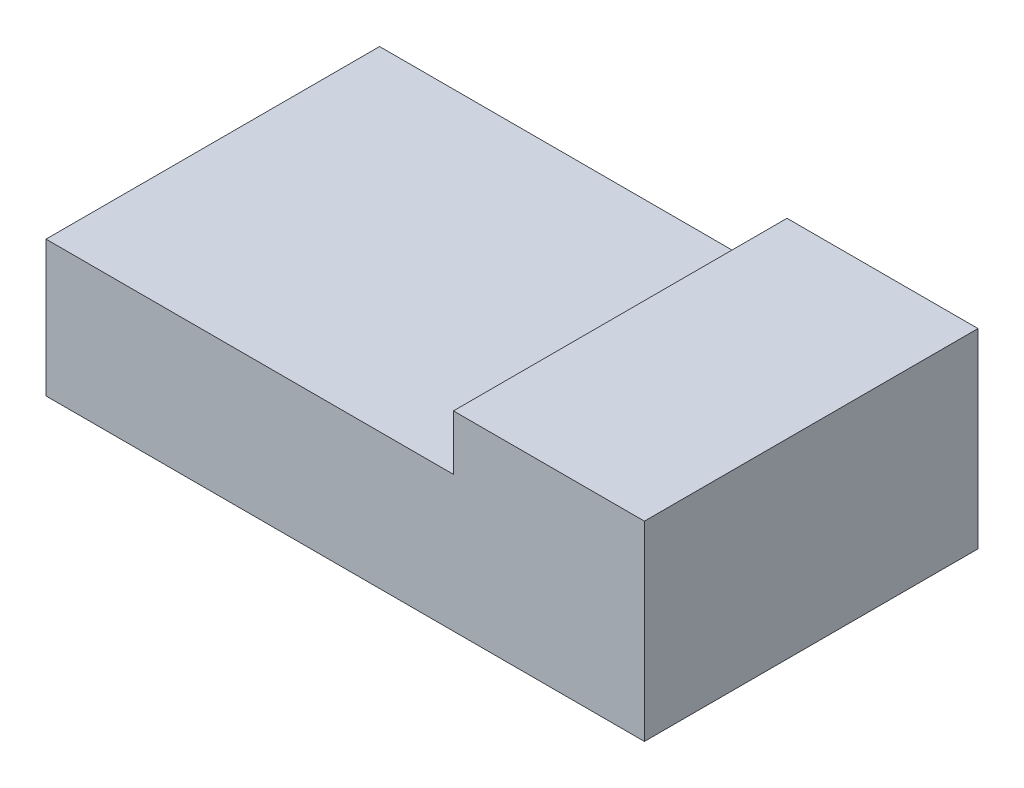
ISO-10303-21;
HEADER;
FILE_DESCRIPTION(('STEP AP214'),'2;1');
FILE_NAME('part.step','',(''),(''),'','','');
FILE_SCHEMA(('AUTOMOTIVE_DESIGN { 1 0 10303 214 1 1 1 1 }'));
ENDSEC;
DATA;
#1=APPLICATION_CONTEXT('core data for automotive mechanical design processes');
#2=APPLICATION_PROTOCOL_DEFINITION('international standard','automotive_design',2000,#1);
#3=PRODUCT_CONTEXT('',#1,'mechanical');
#4=PRODUCT('Part','Part','',(#3));
#5=PRODUCT_RELATED_PRODUCT_CATEGORY('part','',(#4));
#6=PRODUCT_DEFINITION_FORMATION('','',#4);
#7=PRODUCT_DEFINITION_CONTEXT('part definition',#1,'design');
#8=PRODUCT_DEFINITION('design','',#6,#7);
#9=PRODUCT_DEFINITION_SHAPE('','',#8);
#10=(LENGTH_UNIT() NAMED_UNIT(*) SI_UNIT(.MILLI.,.METRE.));
#11=(NAMED_UNIT(*) PLANE_ANGLE_UNIT() SI_UNIT($,.RADIAN.));
#12=(NAMED_UNIT(*) SI_UNIT($,.STERADIAN.) SOLID_ANGLE_UNIT());
#13=UNCERTAINTY_MEASURE_WITH_UNIT(LENGTH_MEASURE(1.E-05),#10,'distance_accuracy_value','');
#14=(GEOMETRIC_REPRESENTATION_CONTEXT(3) GLOBAL_UNCERTAINTY_ASSIGNED_CONTEXT((#13)) GLOBAL_UNIT_ASSIGNED_CONTEXT((#10,
#11,#12)) REPRESENTATION_CONTEXT('',''));
#15=CARTESIAN_POINT('',(0.,0.,0.));
#16=DIRECTION('',(0.,0.,1.));
#17=DIRECTION('',(1.,0.,0.));
#18=AXIS2_PLACEMENT_3D('',#15,#16,#17);
#19=CARTESIAN_POINT('',(0.,10.668,0.));
#20=DIRECTION('',(1.,0.,0.));
#21=DIRECTION('',(0.,0.,-1.));
#22=AXIS2_PLACEMENT_3D('',#19,#20,#21);
#23=PLANE('',#22);
#24=DIRECTION('',(0.,0.,1.));
#25=VECTOR('',#24,1.);
#26=CARTESIAN_POINT('',(0.,0.,0.));
#27=LINE('',#26,#25);
#28=CARTESIAN_POINT('',(0.,0.,0.));
#29=VERTEX_POINT('',#28);
#30=CARTESIAN_POINT('',(0.,0.,26.2));
#31=VERTEX_POINT('',#30);
#32=EDGE_CURVE('E93',#29,#31,#27,.T.);
#33=ORIENTED_EDGE('',*,*,#32,.T.);
#34=DIRECTION('',(0.,-1.,0.));
#35=VECTOR('',#34,1.);
#36=CARTESIAN_POINT('',(0.,10.668,26.2));
#37=LINE('',#36,#35);
#38=CARTESIAN_POINT('',(0.,10.668,26.2));
#39=VERTEX_POINT('',#38);
#40=EDGE_CURVE('E12',#39,#31,#37,.T.);
#41=ORIENTED_EDGE('',*,*,#40,.F.);
#42=DIRECTION('',(0.,0.,1.));
#43=VECTOR('',#42,1.);
#44=CARTESIAN_POINT('',(0.,10.668,0.));
#45=LINE('',#44,#43);
#46=CARTESIAN_POINT('',(0.,10.668,0.));
#47=VERTEX_POINT('',#46);
#48=EDGE_CURVE('E87',#47,#39,#45,.T.);
#49=ORIENTED_EDGE('',*,*,#48,.F.);
#50=DIRECTION('',(0.,-1.,0.));
#51=VECTOR('',#50,1.);
#52=CARTESIAN_POINT('',(0.,10.668,0.));
#53=LINE('',#52,#51);
#54=EDGE_CURVE('E79',#47,#29,#53,.T.);
#55=ORIENTED_EDGE('',*,*,#54,.T.);
#56=EDGE_LOOP('',(#33,#41,#49,#55));
#57=FACE_BOUND('',#56,.T.);
#58=ADVANCED_FACE('F37',(#57),#23,.F.);
#59=CARTESIAN_POINT('',(0.,10.668,26.2));
#60=DIRECTION('',(0.,0.,-1.));
#61=DIRECTION('',(-1.,0.,0.));
#62=AXIS2_PLACEMENT_3D('',#59,#60,#61);
#63=PLANE('',#62);
#64=DIRECTION('',(1.,0.,0.));
#65=VECTOR('',#64,1.);
#66=CARTESIAN_POINT('',(0.,0.,26.2));
#67=LINE('',#66,#65);
#68=CARTESIAN_POINT('',(47.,0.,26.2));
#69=VERTEX_POINT('',#68);
#70=EDGE_CURVE('E96',#31,#69,#67,.T.);
#71=ORIENTED_EDGE('',*,*,#70,.T.);
#72=DIRECTION('',(0.,-1.,0.));
#73=VECTOR('',#72,1.);
#74=CARTESIAN_POINT('',(47.,10.668,26.2));
#75=LINE('',#74,#73);
#76=CARTESIAN_POINT('',(47.,14.986,26.2));
#77=VERTEX_POINT('',#76);
#78=EDGE_CURVE('E44',#77,#69,#75,.T.);
#79=ORIENTED_EDGE('',*,*,#78,.F.);
#80=DIRECTION('',(1.,0.,0.));
#81=VECTOR('',#80,1.);
#82=CARTESIAN_POINT('',(47.,14.986,26.2));
#83=LINE('',#82,#81);
#84=CARTESIAN_POINT('',(32.,14.986,26.2));
#85=VERTEX_POINT('',#84);
#86=EDGE_CURVE('E120',#85,#77,#83,.T.);
#87=ORIENTED_EDGE('',*,*,#86,.F.);
#88=DIRECTION('',(0.,-1.,0.));
#89=VECTOR('',#88,1.);
#90=CARTESIAN_POINT('',(32.,60.162064590855,26.2));
#91=LINE('',#90,#89);
#92=CARTESIAN_POINT('',(32.,10.668,26.2));
#93=VERTEX_POINT('',#92);
#94=EDGE_CURVE('E131',#85,#93,#91,.T.);
#95=ORIENTED_EDGE('',*,*,#94,.T.);
#96=DIRECTION('',(1.,0.,0.));
#97=VECTOR('',#96,1.);
#98=CARTESIAN_POINT('',(0.,10.668,26.2));
#99=LINE('',#98,#97);
#100=EDGE_CURVE('E141',#39,#93,#99,.T.);
#101=ORIENTED_EDGE('',*,*,#100,.F.);
#102=ORIENTED_EDGE('',*,*,#40,.T.);
#103=EDGE_LOOP('',(#71,#79,#87,#95,#101,#102));
#104=FACE_BOUND('',#103,.T.);
#105=ADVANCED_FACE('F117',(#104),#63,.F.);
#106=CARTESIAN_POINT('',(47.,10.668,0.));
#107=DIRECTION('',(-1.,0.,0.));
#108=DIRECTION('',(0.,0.,1.));
#109=AXIS2_PLACEMENT_3D('',#106,#107,#108);
#110=PLANE('',#109);
#111=DIRECTION('',(0.,0.,-1.));
#112=VECTOR('',#111,1.);
#113=CARTESIAN_POINT('',(47.,0.,0.));
#114=LINE('',#113,#112);
#115=CARTESIAN_POINT('',(47.,0.,0.));
#116=VERTEX_POINT('',#115);
#117=EDGE_CURVE('E88',#69,#116,#114,.T.);
#118=ORIENTED_EDGE('',*,*,#117,.T.);
#119=DIRECTION('',(0.,-1.,0.));
#120=VECTOR('',#119,1.);
#121=CARTESIAN_POINT('',(47.,10.668,0.));
#122=LINE('',#121,#120);
#123=CARTESIAN_POINT('',(47.,14.986,0.));
#124=VERTEX_POINT('',#123);
#125=EDGE_CURVE('E83',#124,#116,#122,.T.);
#126=ORIENTED_EDGE('',*,*,#125,.F.);
#127=DIRECTION('',(0.,0.,-1.));
#128=VECTOR('',#127,1.);
#129=CARTESIAN_POINT('',(47.,14.986,0.));
#130=LINE('',#129,#128);
#131=EDGE_CURVE('E113',#77,#124,#130,.T.);
#132=ORIENTED_EDGE('',*,*,#131,.F.);
#133=ORIENTED_EDGE('',*,*,#78,.T.);
#134=EDGE_LOOP('',(#118,#126,#132,#133));
#135=FACE_BOUND('',#134,.T.);
#136=ADVANCED_FACE('F111',(#135),#110,.F.);
#137=CARTESIAN_POINT('',(0.,10.668,0.));
#138=DIRECTION('',(0.,0.,1.));
#139=DIRECTION('',(1.,0.,0.));
#140=AXIS2_PLACEMENT_3D('',#137,#138,#139);
#141=PLANE('',#140);
#142=DIRECTION('',(-1.,0.,0.));
#143=VECTOR('',#142,1.);
#144=CARTESIAN_POINT('',(0.,0.,0.));
#145=LINE('',#144,#143);
#146=EDGE_CURVE('E76',#116,#29,#145,.T.);
#147=ORIENTED_EDGE('',*,*,#146,.T.);
#148=ORIENTED_EDGE('',*,*,#54,.F.);
#149=DIRECTION('',(-1.,0.,0.));
#150=VECTOR('',#149,1.);
#151=CARTESIAN_POINT('',(0.,10.668,0.));
#152=LINE('',#151,#150);
#153=CARTESIAN_POINT('',(32.,10.668,0.));
#154=VERTEX_POINT('',#153);
#155=EDGE_CURVE('E56',#154,#47,#152,.T.);
#156=ORIENTED_EDGE('',*,*,#155,.F.);
#157=DIRECTION('',(0.,-1.,0.));
#158=VECTOR('',#157,1.);
#159=CARTESIAN_POINT('',(32.,60.162064590855,0.));
#160=LINE('',#159,#158);
#161=CARTESIAN_POINT('',(32.,14.986,0.));
#162=VERTEX_POINT('',#161);
#163=EDGE_CURVE('E137',#162,#154,#160,.T.);
#164=ORIENTED_EDGE('',*,*,#163,.F.);
#165=DIRECTION('',(-1.,0.,0.));
#166=VECTOR('',#165,1.);
#167=CARTESIAN_POINT('',(47.,14.986,0.));
#168=LINE('',#167,#166);
#169=EDGE_CURVE('E101',#124,#162,#168,.T.);
#170=ORIENTED_EDGE('',*,*,#169,.F.);
#171=ORIENTED_EDGE('',*,*,#125,.T.);
#172=EDGE_LOOP('',(#147,#148,#156,#164,#170,#171));
#173=FACE_BOUND('',#172,.T.);
#174=ADVANCED_FACE('F78',(#173),#141,.F.);
#175=CARTESIAN_POINT('',(0.,10.668,0.));
#176=DIRECTION('',(0.,1.,0.));
#177=DIRECTION('',(0.,0.,1.));
#178=AXIS2_PLACEMENT_3D('',#175,#176,#177);
#179=PLANE('',#178);
#180=DIRECTION('',(0.,0.,1.));
#181=VECTOR('',#180,1.);
#182=CARTESIAN_POINT('',(32.,10.668,0.));
#183=LINE('',#182,#181);
#184=EDGE_CURVE('E51',#154,#93,#183,.T.);
#185=ORIENTED_EDGE('',*,*,#184,.F.);
#186=ORIENTED_EDGE('',*,*,#155,.T.);
#187=ORIENTED_EDGE('',*,*,#48,.T.);
#188=ORIENTED_EDGE('',*,*,#100,.T.);
#189=EDGE_LOOP('',(#185,#186,#187,#188));
#190=FACE_BOUND('',#189,.T.);
#191=ADVANCED_FACE('F142',(#190),#179,.T.);
#192=CARTESIAN_POINT('',(0.,0.,0.));
#193=DIRECTION('',(0.,1.,0.));
#194=DIRECTION('',(0.,0.,1.));
#195=AXIS2_PLACEMENT_3D('',#192,#193,#194);
#196=PLANE('',#195);
#197=ORIENTED_EDGE('',*,*,#32,.F.);
#198=ORIENTED_EDGE('',*,*,#146,.F.);
#199=ORIENTED_EDGE('',*,*,#117,.F.);
#200=ORIENTED_EDGE('',*,*,#70,.F.);
#201=EDGE_LOOP('',(#197,#198,#199,#200));
#202=FACE_BOUND('',#201,.T.);
#203=ADVANCED_FACE('F95',(#202),#196,.F.);
#204=CARTESIAN_POINT('',(32.,60.162064590855,0.));
#205=DIRECTION('',(1.,0.,0.));
#206=DIRECTION('',(0.,0.,-1.));
#207=AXIS2_PLACEMENT_3D('',#204,#205,#206);
#208=PLANE('',#207);
#209=DIRECTION('',(0.,0.,1.));
#210=VECTOR('',#209,1.);
#211=CARTESIAN_POINT('',(32.,14.986,0.));
#212=LINE('',#211,#210);
#213=EDGE_CURVE('E97',#162,#85,#212,.T.);
#214=ORIENTED_EDGE('',*,*,#213,.F.);
#215=ORIENTED_EDGE('',*,*,#163,.T.);
#216=ORIENTED_EDGE('',*,*,#184,.T.);
#217=ORIENTED_EDGE('',*,*,#94,.F.);
#218=EDGE_LOOP('',(#214,#215,#216,#217));
#219=FACE_BOUND('',#218,.T.);
#220=ADVANCED_FACE('F132',(#219),#208,.F.);
#221=CARTESIAN_POINT('',(0.,14.986,0.));
#222=DIRECTION('',(0.,1.,0.));
#223=DIRECTION('',(0.,0.,1.));
#224=AXIS2_PLACEMENT_3D('',#221,#222,#223);
#225=PLANE('',#224);
#226=ORIENTED_EDGE('',*,*,#86,.T.);
#227=ORIENTED_EDGE('',*,*,#131,.T.);
#228=ORIENTED_EDGE('',*,*,#169,.T.);
#229=ORIENTED_EDGE('',*,*,#213,.T.);
#230=EDGE_LOOP('',(#226,#227,#228,#229));
#231=FACE_BOUND('',#230,.T.);
#232=ADVANCED_FACE('F181',(#231),#225,.T.);
#233=CLOSED_SHELL('',(#58,#105,#136,#174,#191,#203,#220,#232));
#234=MANIFOLD_SOLID_BREP('B2',#233);
#235=ADVANCED_BREP_SHAPE_REPRESENTATION('',(#18,#234),#14);
#236=SHAPE_DEFINITION_REPRESENTATION(#9,#235);
ENDSEC;
END-ISO-10303-21;
